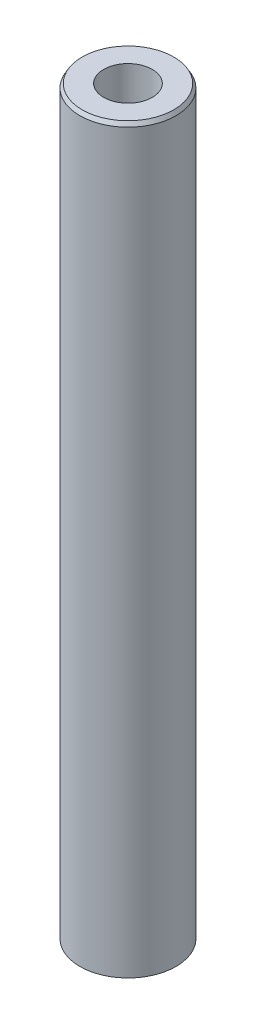
ISO-10303-21;
HEADER;
FILE_DESCRIPTION(('STEP AP214'),'2;1');
FILE_NAME('part.step','',(''),(''),'','','');
FILE_SCHEMA(('AUTOMOTIVE_DESIGN { 1 0 10303 214 1 1 1 1 }'));
ENDSEC;
DATA;
#1=APPLICATION_CONTEXT('core data for automotive mechanical design processes');
#2=APPLICATION_PROTOCOL_DEFINITION('international standard','automotive_design',2000,#1);
#3=PRODUCT_CONTEXT('',#1,'mechanical');
#4=PRODUCT('Part','Part','',(#3));
#5=PRODUCT_RELATED_PRODUCT_CATEGORY('part','',(#4));
#6=PRODUCT_DEFINITION_FORMATION('','',#4);
#7=PRODUCT_DEFINITION_CONTEXT('part definition',#1,'design');
#8=PRODUCT_DEFINITION('design','',#6,#7);
#9=PRODUCT_DEFINITION_SHAPE('','',#8);
#10=(LENGTH_UNIT() NAMED_UNIT(*) SI_UNIT(.MILLI.,.METRE.));
#11=(NAMED_UNIT(*) PLANE_ANGLE_UNIT() SI_UNIT($,.RADIAN.));
#12=(NAMED_UNIT(*) SI_UNIT($,.STERADIAN.) SOLID_ANGLE_UNIT());
#13=UNCERTAINTY_MEASURE_WITH_UNIT(LENGTH_MEASURE(1.E-05),#10,'distance_accuracy_value','');
#14=(GEOMETRIC_REPRESENTATION_CONTEXT(3) GLOBAL_UNCERTAINTY_ASSIGNED_CONTEXT((#13)) GLOBAL_UNIT_ASSIGNED_CONTEXT((#10,
#11,#12)) REPRESENTATION_CONTEXT('',''));
#15=CARTESIAN_POINT('',(0.,0.,0.));
#16=DIRECTION('',(0.,0.,1.));
#17=DIRECTION('',(1.,0.,0.));
#18=AXIS2_PLACEMENT_3D('',#15,#16,#17);
#19=CARTESIAN_POINT('',(0.,502.301161616878,0.));
#20=DIRECTION('',(0.,-1.,0.));
#21=DIRECTION('',(0.,0.,-1.));
#22=AXIS2_PLACEMENT_3D('',#19,#20,#21);
#23=CYLINDRICAL_SURFACE('',#22,32.5);
#24=CARTESIAN_POINT('',(0.,499.620846843975,0.));
#25=DIRECTION('',(0.,1.,0.));
#26=DIRECTION('',(0.,0.,1.));
#27=AXIS2_PLACEMENT_3D('',#24,#25,#26);
#28=CIRCLE('',#27,32.5);
#29=CARTESIAN_POINT('',(0.,499.620846843975,32.5));
#30=VERTEX_POINT('',#29);
#31=EDGE_CURVE('E50',#30,#30,#28,.F.);
#32=ORIENTED_EDGE('',*,*,#31,.T.);
#33=EDGE_LOOP('',(#32));
#34=FACE_BOUND('',#33,.T.);
#35=CARTESIAN_POINT('',(0.,1.54748045564834,0.));
#36=DIRECTION('',(0.,1.,0.));
#37=DIRECTION('',(0.,0.,1.));
#38=AXIS2_PLACEMENT_3D('',#35,#36,#37);
#39=CIRCLE('',#38,32.5);
#40=CARTESIAN_POINT('',(0.,1.54748045564834,32.5));
#41=VERTEX_POINT('',#40);
#42=EDGE_CURVE('E51',#41,#41,#39,.T.);
#43=ORIENTED_EDGE('',*,*,#42,.T.);
#44=EDGE_LOOP('',(#43));
#45=FACE_BOUND('',#44,.T.);
#46=ADVANCED_FACE('F39',(#34,#45),#23,.T.);
#47=CARTESIAN_POINT('',(0.,502.301161616878,0.));
#48=DIRECTION('',(0.,1.,0.));
#49=DIRECTION('',(0.,0.,1.));
#50=AXIS2_PLACEMENT_3D('',#47,#48,#49);
#51=PLANE('',#50);
#52=CARTESIAN_POINT('',(0.,502.301161616878,0.));
#53=DIRECTION('',(0.,1.,0.));
#54=DIRECTION('',(0.,0.,1.));
#55=AXIS2_PLACEMENT_3D('',#52,#53,#54);
#56=CIRCLE('',#55,30.9525195443515);
#57=CARTESIAN_POINT('',(0.,502.301161616878,30.9525195443515));
#58=VERTEX_POINT('',#57);
#59=EDGE_CURVE('E54',#58,#58,#56,.T.);
#60=ORIENTED_EDGE('',*,*,#59,.T.);
#61=EDGE_LOOP('',(#60));
#62=FACE_BOUND('',#61,.T.);
#63=CARTESIAN_POINT('',(0.,502.301161616878,0.));
#64=DIRECTION('',(0.,1.,0.));
#65=DIRECTION('',(0.,0.,1.));
#66=AXIS2_PLACEMENT_3D('',#63,#64,#65);
#67=CIRCLE('',#66,16.4253113508777);
#68=CARTESIAN_POINT('',(0.,502.301161616878,16.4253113508777));
#69=VERTEX_POINT('',#68);
#70=EDGE_CURVE('E58',#69,#69,#67,.T.);
#71=ORIENTED_EDGE('',*,*,#70,.F.);
#72=EDGE_LOOP('',(#71));
#73=FACE_BOUND('',#72,.T.);
#74=ADVANCED_FACE('F69',(#62,#73),#51,.T.);
#75=CARTESIAN_POINT('',(0.,0.,0.));
#76=DIRECTION('',(0.,1.,0.));
#77=DIRECTION('',(0.,0.,1.));
#78=AXIS2_PLACEMENT_3D('',#75,#76,#77);
#79=PLANE('',#78);
#80=CARTESIAN_POINT('',(0.,0.,0.));
#81=DIRECTION('',(0.,1.,0.));
#82=DIRECTION('',(0.,0.,1.));
#83=AXIS2_PLACEMENT_3D('',#80,#81,#82);
#84=CIRCLE('',#83,29.8196852270972);
#85=CARTESIAN_POINT('',(0.,0.,29.8196852270972));
#86=VERTEX_POINT('',#85);
#87=EDGE_CURVE('E10',#86,#86,#84,.F.);
#88=ORIENTED_EDGE('',*,*,#87,.T.);
#89=EDGE_LOOP('',(#88));
#90=FACE_BOUND('',#89,.T.);
#91=CARTESIAN_POINT('',(0.,0.,0.));
#92=DIRECTION('',(0.,1.,0.));
#93=DIRECTION('',(0.,0.,1.));
#94=AXIS2_PLACEMENT_3D('',#91,#92,#93);
#95=CIRCLE('',#94,16.4253113508777);
#96=CARTESIAN_POINT('',(0.,0.,16.4253113508777));
#97=VERTEX_POINT('',#96);
#98=EDGE_CURVE('E63',#97,#97,#95,.T.);
#99=ORIENTED_EDGE('',*,*,#98,.T.);
#100=EDGE_LOOP('',(#99));
#101=FACE_BOUND('',#100,.T.);
#102=ADVANCED_FACE('F75',(#90,#101),#79,.F.);
#103=CARTESIAN_POINT('',(0.,502.301161616878,0.));
#104=DIRECTION('',(0.,-1.,0.));
#105=DIRECTION('',(0.,0.,-1.));
#106=AXIS2_PLACEMENT_3D('',#103,#104,#105);
#107=CYLINDRICAL_SURFACE('',#106,16.4253113508777);
#108=ORIENTED_EDGE('',*,*,#70,.T.);
#109=EDGE_LOOP('',(#108));
#110=FACE_BOUND('',#109,.T.);
#111=ORIENTED_EDGE('',*,*,#98,.F.);
#112=EDGE_LOOP('',(#111));
#113=FACE_BOUND('',#112,.T.);
#114=ADVANCED_FACE('F70',(#110,#113),#107,.F.);
#115=CARTESIAN_POINT('',(0.,502.301161616878,0.));
#116=DIRECTION('',(0.,-1.,0.));
#117=DIRECTION('',(0.,0.,-1.));
#118=AXIS2_PLACEMENT_3D('',#115,#116,#117);
#119=CONICAL_SURFACE('',#118,30.9525195443515,0.52359877559831);
#120=ORIENTED_EDGE('',*,*,#31,.F.);
#121=EDGE_LOOP('',(#120));
#122=FACE_BOUND('',#121,.T.);
#123=ORIENTED_EDGE('',*,*,#59,.F.);
#124=EDGE_LOOP('',(#123));
#125=FACE_BOUND('',#124,.T.);
#126=ADVANCED_FACE('F81',(#122,#125),#119,.T.);
#127=CARTESIAN_POINT('',(0.,1.54748045564834,0.));
#128=DIRECTION('',(0.,1.,0.));
#129=DIRECTION('',(0.,0.,1.));
#130=AXIS2_PLACEMENT_3D('',#127,#128,#129);
#131=CONICAL_SURFACE('',#130,32.5,1.04719755119661);
#132=ORIENTED_EDGE('',*,*,#87,.F.);
#133=EDGE_LOOP('',(#132));
#134=FACE_BOUND('',#133,.T.);
#135=ORIENTED_EDGE('',*,*,#42,.F.);
#136=EDGE_LOOP('',(#135));
#137=FACE_BOUND('',#136,.T.);
#138=ADVANCED_FACE('F45',(#134,#137),#131,.T.);
#139=CLOSED_SHELL('',(#46,#74,#102,#114,#126,#138));
#140=MANIFOLD_SOLID_BREP('B2',#139);
#141=ADVANCED_BREP_SHAPE_REPRESENTATION('',(#18,#140),#14);
#142=SHAPE_DEFINITION_REPRESENTATION(#9,#141);
ENDSEC;
END-ISO-10303-21;
